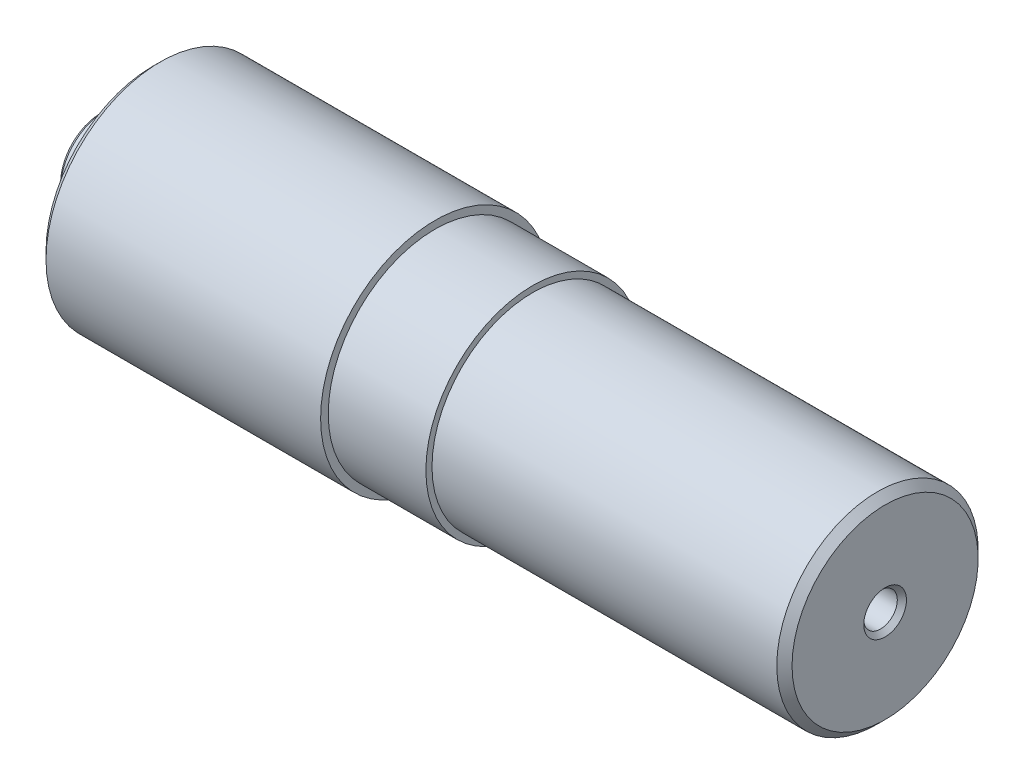
ISO-10303-21;
HEADER;
FILE_DESCRIPTION(('STEP AP214'),'2;1');
FILE_NAME('part.step','',(''),(''),'','','');
FILE_SCHEMA(('AUTOMOTIVE_DESIGN { 1 0 10303 214 1 1 1 1 }'));
ENDSEC;
DATA;
#1=APPLICATION_CONTEXT('core data for automotive mechanical design processes');
#2=APPLICATION_PROTOCOL_DEFINITION('international standard','automotive_design',2000,#1);
#3=PRODUCT_CONTEXT('',#1,'mechanical');
#4=PRODUCT('Part','Part','',(#3));
#5=PRODUCT_RELATED_PRODUCT_CATEGORY('part','',(#4));
#6=PRODUCT_DEFINITION_FORMATION('','',#4);
#7=PRODUCT_DEFINITION_CONTEXT('part definition',#1,'design');
#8=PRODUCT_DEFINITION('design','',#6,#7);
#9=PRODUCT_DEFINITION_SHAPE('','',#8);
#10=(LENGTH_UNIT() NAMED_UNIT(*) SI_UNIT(.MILLI.,.METRE.));
#11=(NAMED_UNIT(*) PLANE_ANGLE_UNIT() SI_UNIT($,.RADIAN.));
#12=(NAMED_UNIT(*) SI_UNIT($,.STERADIAN.) SOLID_ANGLE_UNIT());
#13=UNCERTAINTY_MEASURE_WITH_UNIT(LENGTH_MEASURE(1.E-05),#10,'distance_accuracy_value','');
#14=(GEOMETRIC_REPRESENTATION_CONTEXT(3) GLOBAL_UNCERTAINTY_ASSIGNED_CONTEXT((#13)) GLOBAL_UNIT_ASSIGNED_CONTEXT((#10,
#11,#12)) REPRESENTATION_CONTEXT('',''));
#15=CARTESIAN_POINT('',(0.,0.,0.));
#16=DIRECTION('',(0.,0.,1.));
#17=DIRECTION('',(1.,0.,0.));
#18=AXIS2_PLACEMENT_3D('',#15,#16,#17);
#19=CARTESIAN_POINT('',(0.,0.,0.));
#20=DIRECTION('',(1.,0.,0.));
#21=DIRECTION('',(0.,0.,-1.));
#22=AXIS2_PLACEMENT_3D('',#19,#20,#21);
#23=PLANE('',#22);
#24=CARTESIAN_POINT('',(0.,0.,0.));
#25=DIRECTION('',(-1.,0.,0.));
#26=DIRECTION('',(0.,0.,1.));
#27=AXIS2_PLACEMENT_3D('',#24,#25,#26);
#28=CIRCLE('',#27,7.);
#29=CARTESIAN_POINT('',(0.,0.,7.));
#30=VERTEX_POINT('',#29);
#31=EDGE_CURVE('E70',#30,#30,#28,.T.);
#32=ORIENTED_EDGE('',*,*,#31,.F.);
#33=EDGE_LOOP('',(#32));
#34=FACE_BOUND('',#33,.T.);
#35=CARTESIAN_POINT('',(0.,0.,0.));
#36=DIRECTION('',(1.,0.,0.));
#37=DIRECTION('',(0.,0.,-1.));
#38=AXIS2_PLACEMENT_3D('',#35,#36,#37);
#39=CIRCLE('',#38,13.2);
#40=CARTESIAN_POINT('',(0.,0.,-13.2));
#41=VERTEX_POINT('',#40);
#42=EDGE_CURVE('E53',#41,#41,#39,.F.);
#43=ORIENTED_EDGE('',*,*,#42,.T.);
#44=EDGE_LOOP('',(#43));
#45=FACE_BOUND('',#44,.T.);
#46=ADVANCED_FACE('F43',(#34,#45),#23,.F.);
#47=CARTESIAN_POINT('',(0.,0.,0.));
#48=DIRECTION('',(-1.,0.,0.));
#49=DIRECTION('',(0.,0.,1.));
#50=AXIS2_PLACEMENT_3D('',#47,#48,#49);
#51=CYLINDRICAL_SURFACE('',#50,14.7);
#52=CARTESIAN_POINT('',(1.49999999999992,0.,0.));
#53=DIRECTION('',(1.,0.,0.));
#54=DIRECTION('',(0.,0.,-1.));
#55=AXIS2_PLACEMENT_3D('',#52,#53,#54);
#56=CIRCLE('',#55,14.7);
#57=CARTESIAN_POINT('',(1.49999999999992,0.,-14.7));
#58=VERTEX_POINT('',#57);
#59=EDGE_CURVE('E11',#58,#58,#56,.T.);
#60=ORIENTED_EDGE('',*,*,#59,.T.);
#61=EDGE_LOOP('',(#60));
#62=FACE_BOUND('',#61,.T.);
#63=CARTESIAN_POINT('',(17.,0.,0.));
#64=DIRECTION('',(-1.,0.,0.));
#65=DIRECTION('',(0.,0.,1.));
#66=AXIS2_PLACEMENT_3D('',#63,#64,#65);
#67=CIRCLE('',#66,14.7);
#68=CARTESIAN_POINT('',(17.,0.,14.7));
#69=VERTEX_POINT('',#68);
#70=EDGE_CURVE('E106',#69,#69,#67,.T.);
#71=ORIENTED_EDGE('',*,*,#70,.T.);
#72=EDGE_LOOP('',(#71));
#73=FACE_BOUND('',#72,.T.);
#74=ADVANCED_FACE('F144',(#62,#73),#51,.T.);
#75=CARTESIAN_POINT('',(17.,14.7,0.));
#76=DIRECTION('',(1.,0.,0.));
#77=DIRECTION('',(0.,0.,-1.));
#78=AXIS2_PLACEMENT_3D('',#75,#76,#77);
#79=PLANE('',#78);
#80=CARTESIAN_POINT('',(17.,0.,0.));
#81=DIRECTION('',(1.,0.,0.));
#82=DIRECTION('',(0.,0.,-1.));
#83=AXIS2_PLACEMENT_3D('',#80,#81,#82);
#84=CIRCLE('',#83,35.);
#85=CARTESIAN_POINT('',(17.,0.,-35.));
#86=VERTEX_POINT('',#85);
#87=EDGE_CURVE('E118',#86,#86,#84,.F.);
#88=ORIENTED_EDGE('',*,*,#87,.T.);
#89=EDGE_LOOP('',(#88));
#90=FACE_BOUND('',#89,.T.);
#91=ORIENTED_EDGE('',*,*,#70,.F.);
#92=EDGE_LOOP('',(#91));
#93=FACE_BOUND('',#92,.T.);
#94=ADVANCED_FACE('F150',(#90,#93),#79,.F.);
#95=CARTESIAN_POINT('',(0.,0.,0.));
#96=DIRECTION('',(-1.,0.,0.));
#97=DIRECTION('',(0.,0.,1.));
#98=AXIS2_PLACEMENT_3D('',#95,#96,#97);
#99=CYLINDRICAL_SURFACE('',#98,37.5);
#100=CARTESIAN_POINT('',(19.5,0.,0.));
#101=DIRECTION('',(1.,0.,0.));
#102=DIRECTION('',(0.,0.,-1.));
#103=AXIS2_PLACEMENT_3D('',#100,#101,#102);
#104=CIRCLE('',#103,37.5);
#105=CARTESIAN_POINT('',(19.5,0.,-37.5));
#106=VERTEX_POINT('',#105);
#107=EDGE_CURVE('E122',#106,#106,#104,.T.);
#108=ORIENTED_EDGE('',*,*,#107,.T.);
#109=EDGE_LOOP('',(#108));
#110=FACE_BOUND('',#109,.T.);
#111=CARTESIAN_POINT('',(109.5,0.,0.));
#112=DIRECTION('',(-1.,0.,0.));
#113=DIRECTION('',(0.,0.,1.));
#114=AXIS2_PLACEMENT_3D('',#111,#112,#113);
#115=CIRCLE('',#114,37.5);
#116=CARTESIAN_POINT('',(109.5,0.,37.5));
#117=VERTEX_POINT('',#116);
#118=EDGE_CURVE('E102',#117,#117,#115,.T.);
#119=ORIENTED_EDGE('',*,*,#118,.T.);
#120=EDGE_LOOP('',(#119));
#121=FACE_BOUND('',#120,.T.);
#122=ADVANCED_FACE('F197',(#110,#121),#99,.T.);
#123=CARTESIAN_POINT('',(109.5,37.5,0.));
#124=DIRECTION('',(-1.,0.,0.));
#125=DIRECTION('',(0.,0.,1.));
#126=AXIS2_PLACEMENT_3D('',#123,#124,#125);
#127=PLANE('',#126);
#128=ORIENTED_EDGE('',*,*,#118,.F.);
#129=EDGE_LOOP('',(#128));
#130=FACE_BOUND('',#129,.T.);
#131=CARTESIAN_POINT('',(109.5,0.,0.));
#132=DIRECTION('',(-1.,0.,0.));
#133=DIRECTION('',(0.,0.,1.));
#134=AXIS2_PLACEMENT_3D('',#131,#132,#133);
#135=CIRCLE('',#134,35.);
#136=CARTESIAN_POINT('',(109.5,0.,35.));
#137=VERTEX_POINT('',#136);
#138=EDGE_CURVE('E98',#137,#137,#135,.T.);
#139=ORIENTED_EDGE('',*,*,#138,.T.);
#140=EDGE_LOOP('',(#139));
#141=FACE_BOUND('',#140,.T.);
#142=ADVANCED_FACE('F190',(#130,#141),#127,.F.);
#143=CARTESIAN_POINT('',(0.,0.,0.));
#144=DIRECTION('',(-1.,0.,0.));
#145=DIRECTION('',(0.,0.,1.));
#146=AXIS2_PLACEMENT_3D('',#143,#144,#145);
#147=CYLINDRICAL_SURFACE('',#146,35.);
#148=ORIENTED_EDGE('',*,*,#138,.F.);
#149=EDGE_LOOP('',(#148));
#150=FACE_BOUND('',#149,.T.);
#151=CARTESIAN_POINT('',(141.5,0.,0.));
#152=DIRECTION('',(-1.,0.,0.));
#153=DIRECTION('',(0.,0.,1.));
#154=AXIS2_PLACEMENT_3D('',#151,#152,#153);
#155=CIRCLE('',#154,35.);
#156=CARTESIAN_POINT('',(141.5,0.,35.));
#157=VERTEX_POINT('',#156);
#158=EDGE_CURVE('E94',#157,#157,#155,.T.);
#159=ORIENTED_EDGE('',*,*,#158,.T.);
#160=EDGE_LOOP('',(#159));
#161=FACE_BOUND('',#160,.T.);
#162=ADVANCED_FACE('F184',(#150,#161),#147,.T.);
#163=CARTESIAN_POINT('',(141.5,35.,0.));
#164=DIRECTION('',(-1.,0.,0.));
#165=DIRECTION('',(0.,0.,1.));
#166=AXIS2_PLACEMENT_3D('',#163,#164,#165);
#167=PLANE('',#166);
#168=ORIENTED_EDGE('',*,*,#158,.F.);
#169=EDGE_LOOP('',(#168));
#170=FACE_BOUND('',#169,.T.);
#171=CARTESIAN_POINT('',(141.5,0.,0.));
#172=DIRECTION('',(-1.,0.,0.));
#173=DIRECTION('',(0.,0.,1.));
#174=AXIS2_PLACEMENT_3D('',#171,#172,#173);
#175=CIRCLE('',#174,33.);
#176=CARTESIAN_POINT('',(141.5,0.,33.));
#177=VERTEX_POINT('',#176);
#178=EDGE_CURVE('E90',#177,#177,#175,.T.);
#179=ORIENTED_EDGE('',*,*,#178,.T.);
#180=EDGE_LOOP('',(#179));
#181=FACE_BOUND('',#180,.T.);
#182=ADVANCED_FACE('F179',(#170,#181),#167,.F.);
#183=CARTESIAN_POINT('',(0.,0.,0.));
#184=DIRECTION('',(-1.,0.,0.));
#185=DIRECTION('',(0.,0.,1.));
#186=AXIS2_PLACEMENT_3D('',#183,#184,#185);
#187=CYLINDRICAL_SURFACE('',#186,33.);
#188=CARTESIAN_POINT('',(254.5,0.,0.));
#189=DIRECTION('',(-1.,0.,0.));
#190=DIRECTION('',(0.,0.,1.));
#191=AXIS2_PLACEMENT_3D('',#188,#189,#190);
#192=CIRCLE('',#191,33.);
#193=CARTESIAN_POINT('',(254.5,0.,33.));
#194=VERTEX_POINT('',#193);
#195=EDGE_CURVE('E110',#194,#194,#192,.T.);
#196=ORIENTED_EDGE('',*,*,#195,.T.);
#197=EDGE_LOOP('',(#196));
#198=FACE_BOUND('',#197,.T.);
#199=ORIENTED_EDGE('',*,*,#178,.F.);
#200=EDGE_LOOP('',(#199));
#201=FACE_BOUND('',#200,.T.);
#202=ADVANCED_FACE('F170',(#198,#201),#187,.T.);
#203=CARTESIAN_POINT('',(257.,33.,0.));
#204=DIRECTION('',(-1.,0.,0.));
#205=DIRECTION('',(0.,0.,1.));
#206=AXIS2_PLACEMENT_3D('',#203,#204,#205);
#207=PLANE('',#206);
#208=CARTESIAN_POINT('',(257.,0.,0.));
#209=DIRECTION('',(1.,0.,0.));
#210=DIRECTION('',(0.,0.,-1.));
#211=AXIS2_PLACEMENT_3D('',#208,#209,#210);
#212=CIRCLE('',#211,7.);
#213=CARTESIAN_POINT('',(257.,0.,-7.));
#214=VERTEX_POINT('',#213);
#215=EDGE_CURVE('E79',#214,#214,#212,.T.);
#216=ORIENTED_EDGE('',*,*,#215,.F.);
#217=EDGE_LOOP('',(#216));
#218=FACE_BOUND('',#217,.T.);
#219=CARTESIAN_POINT('',(257.,0.,0.));
#220=DIRECTION('',(-1.,0.,0.));
#221=DIRECTION('',(0.,0.,1.));
#222=AXIS2_PLACEMENT_3D('',#219,#220,#221);
#223=CIRCLE('',#222,30.5);
#224=CARTESIAN_POINT('',(257.,0.,30.5));
#225=VERTEX_POINT('',#224);
#226=EDGE_CURVE('E114',#225,#225,#223,.F.);
#227=ORIENTED_EDGE('',*,*,#226,.T.);
#228=EDGE_LOOP('',(#227));
#229=FACE_BOUND('',#228,.T.);
#230=ADVANCED_FACE('F161',(#218,#229),#207,.F.);
#231=CARTESIAN_POINT('',(254.5,0.,0.));
#232=DIRECTION('',(-1.,0.,0.));
#233=DIRECTION('',(0.,0.,1.));
#234=AXIS2_PLACEMENT_3D('',#231,#232,#233);
#235=CONICAL_SURFACE('',#234,33.,0.785398163397432);
#236=ORIENTED_EDGE('',*,*,#226,.F.);
#237=EDGE_LOOP('',(#236));
#238=FACE_BOUND('',#237,.T.);
#239=ORIENTED_EDGE('',*,*,#195,.F.);
#240=EDGE_LOOP('',(#239));
#241=FACE_BOUND('',#240,.T.);
#242=ADVANCED_FACE('F140',(#238,#241),#235,.T.);
#243=CARTESIAN_POINT('',(17.,0.,0.));
#244=DIRECTION('',(1.,0.,0.));
#245=DIRECTION('',(0.,0.,-1.));
#246=AXIS2_PLACEMENT_3D('',#243,#244,#245);
#247=CONICAL_SURFACE('',#246,35.,0.785398163397448);
#248=ORIENTED_EDGE('',*,*,#107,.F.);
#249=EDGE_LOOP('',(#248));
#250=FACE_BOUND('',#249,.T.);
#251=ORIENTED_EDGE('',*,*,#87,.F.);
#252=EDGE_LOOP('',(#251));
#253=FACE_BOUND('',#252,.T.);
#254=ADVANCED_FACE('F132',(#250,#253),#247,.T.);
#255=CARTESIAN_POINT('',(0.,0.,0.));
#256=DIRECTION('',(1.,0.,0.));
#257=DIRECTION('',(0.,0.,-1.));
#258=AXIS2_PLACEMENT_3D('',#255,#256,#257);
#259=CONICAL_SURFACE('',#258,13.2,0.785398163397459);
#260=ORIENTED_EDGE('',*,*,#59,.F.);
#261=EDGE_LOOP('',(#260));
#262=FACE_BOUND('',#261,.T.);
#263=ORIENTED_EDGE('',*,*,#42,.F.);
#264=EDGE_LOOP('',(#263));
#265=FACE_BOUND('',#264,.T.);
#266=ADVANCED_FACE('F46',(#262,#265),#259,.T.);
#267=CARTESIAN_POINT('',(10.6952665953484,0.,0.));
#268=DIRECTION('',(-1.,0.,0.));
#269=DIRECTION('',(0.,0.,1.));
#270=AXIS2_PLACEMENT_3D('',#267,#268,#269);
#271=CONICAL_SURFACE('',#270,5.49999999999999,1.02974425867665);
#272=CARTESIAN_POINT('',(14.,0.,0.));
#273=VERTEX_POINT('',#272);
#274=VERTEX_LOOP('',#273);
#275=FACE_BOUND('',#274,.T.);
#276=CARTESIAN_POINT('',(10.6952665953484,0.,0.));
#277=DIRECTION('',(-1.,0.,0.));
#278=DIRECTION('',(0.,0.,1.));
#279=AXIS2_PLACEMENT_3D('',#276,#277,#278);
#280=CIRCLE('',#279,5.49999999999999);
#281=CARTESIAN_POINT('',(10.6952665953484,0.,5.49999999999999));
#282=VERTEX_POINT('',#281);
#283=EDGE_CURVE('E86',#282,#282,#280,.T.);
#284=ORIENTED_EDGE('',*,*,#283,.T.);
#285=EDGE_LOOP('',(#284));
#286=FACE_BOUND('',#285,.T.);
#287=ADVANCED_FACE('F131',(#275,#286),#271,.F.);
#288=CARTESIAN_POINT('',(0.,0.,0.));
#289=DIRECTION('',(-1.,0.,0.));
#290=DIRECTION('',(0.,0.,1.));
#291=AXIS2_PLACEMENT_3D('',#288,#289,#290);
#292=CYLINDRICAL_SURFACE('',#291,5.5);
#293=ORIENTED_EDGE('',*,*,#283,.F.);
#294=EDGE_LOOP('',(#293));
#295=FACE_BOUND('',#294,.T.);
#296=CARTESIAN_POINT('',(1.5,0.,0.));
#297=DIRECTION('',(-1.,0.,0.));
#298=DIRECTION('',(0.,0.,1.));
#299=AXIS2_PLACEMENT_3D('',#296,#297,#298);
#300=CIRCLE('',#299,5.5);
#301=CARTESIAN_POINT('',(1.5,0.,5.5));
#302=VERTEX_POINT('',#301);
#303=EDGE_CURVE('E76',#302,#302,#300,.T.);
#304=ORIENTED_EDGE('',*,*,#303,.T.);
#305=EDGE_LOOP('',(#304));
#306=FACE_BOUND('',#305,.T.);
#307=ADVANCED_FACE('F138',(#295,#306),#292,.F.);
#308=CARTESIAN_POINT('',(0.,0.,0.));
#309=DIRECTION('',(-1.,0.,0.));
#310=DIRECTION('',(0.,0.,1.));
#311=AXIS2_PLACEMENT_3D('',#308,#309,#310);
#312=CONICAL_SURFACE('',#311,7.,0.785398163397449);
#313=ORIENTED_EDGE('',*,*,#303,.F.);
#314=EDGE_LOOP('',(#313));
#315=FACE_BOUND('',#314,.T.);
#316=ORIENTED_EDGE('',*,*,#31,.T.);
#317=EDGE_LOOP('',(#316));
#318=FACE_BOUND('',#317,.T.);
#319=ADVANCED_FACE('F63',(#315,#318),#312,.F.);
#320=CARTESIAN_POINT('',(246.304733404652,0.,0.));
#321=DIRECTION('',(1.,0.,0.));
#322=DIRECTION('',(0.,0.,-1.));
#323=AXIS2_PLACEMENT_3D('',#320,#321,#322);
#324=CONICAL_SURFACE('',#323,5.5,1.02974425867665);
#325=CARTESIAN_POINT('',(243.,0.,0.));
#326=VERTEX_POINT('',#325);
#327=VERTEX_LOOP('',#326);
#328=FACE_BOUND('',#327,.T.);
#329=CARTESIAN_POINT('',(246.304733404652,0.,0.));
#330=DIRECTION('',(1.,0.,0.));
#331=DIRECTION('',(0.,0.,-1.));
#332=AXIS2_PLACEMENT_3D('',#329,#330,#331);
#333=CIRCLE('',#332,5.5);
#334=CARTESIAN_POINT('',(246.304733404652,0.,-5.5));
#335=VERTEX_POINT('',#334);
#336=EDGE_CURVE('E67',#335,#335,#333,.T.);
#337=ORIENTED_EDGE('',*,*,#336,.T.);
#338=EDGE_LOOP('',(#337));
#339=FACE_BOUND('',#338,.T.);
#340=ADVANCED_FACE('F59',(#328,#339),#324,.F.);
#341=CARTESIAN_POINT('',(257.,0.,0.));
#342=DIRECTION('',(1.,0.,0.));
#343=DIRECTION('',(0.,0.,-1.));
#344=AXIS2_PLACEMENT_3D('',#341,#342,#343);
#345=CYLINDRICAL_SURFACE('',#344,5.49999999999999);
#346=ORIENTED_EDGE('',*,*,#336,.F.);
#347=EDGE_LOOP('',(#346));
#348=FACE_BOUND('',#347,.T.);
#349=CARTESIAN_POINT('',(255.5,0.,0.));
#350=DIRECTION('',(1.,0.,0.));
#351=DIRECTION('',(0.,0.,-1.));
#352=AXIS2_PLACEMENT_3D('',#349,#350,#351);
#353=CIRCLE('',#352,5.49999999999999);
#354=CARTESIAN_POINT('',(255.5,0.,-5.49999999999999));
#355=VERTEX_POINT('',#354);
#356=EDGE_CURVE('E71',#355,#355,#353,.T.);
#357=ORIENTED_EDGE('',*,*,#356,.T.);
#358=EDGE_LOOP('',(#357));
#359=FACE_BOUND('',#358,.T.);
#360=ADVANCED_FACE('F62',(#348,#359),#345,.F.);
#361=CARTESIAN_POINT('',(257.,0.,0.));
#362=DIRECTION('',(1.,0.,0.));
#363=DIRECTION('',(0.,0.,-1.));
#364=AXIS2_PLACEMENT_3D('',#361,#362,#363);
#365=CONICAL_SURFACE('',#364,7.,0.785398163397433);
#366=ORIENTED_EDGE('',*,*,#356,.F.);
#367=EDGE_LOOP('',(#366));
#368=FACE_BOUND('',#367,.T.);
#369=ORIENTED_EDGE('',*,*,#215,.T.);
#370=EDGE_LOOP('',(#369));
#371=FACE_BOUND('',#370,.T.);
#372=ADVANCED_FACE('F288',(#368,#371),#365,.F.);
#373=CLOSED_SHELL('',(#46,#74,#94,#122,#142,#162,#182,#202,#230,#242,#254,#266,#287,#307,#319,
#340,#360,#372));
#374=MANIFOLD_SOLID_BREP('B2',#373);
#375=ADVANCED_BREP_SHAPE_REPRESENTATION('',(#18,#374),#14);
#376=SHAPE_DEFINITION_REPRESENTATION(#9,#375);
ENDSEC;
END-ISO-10303-21;
